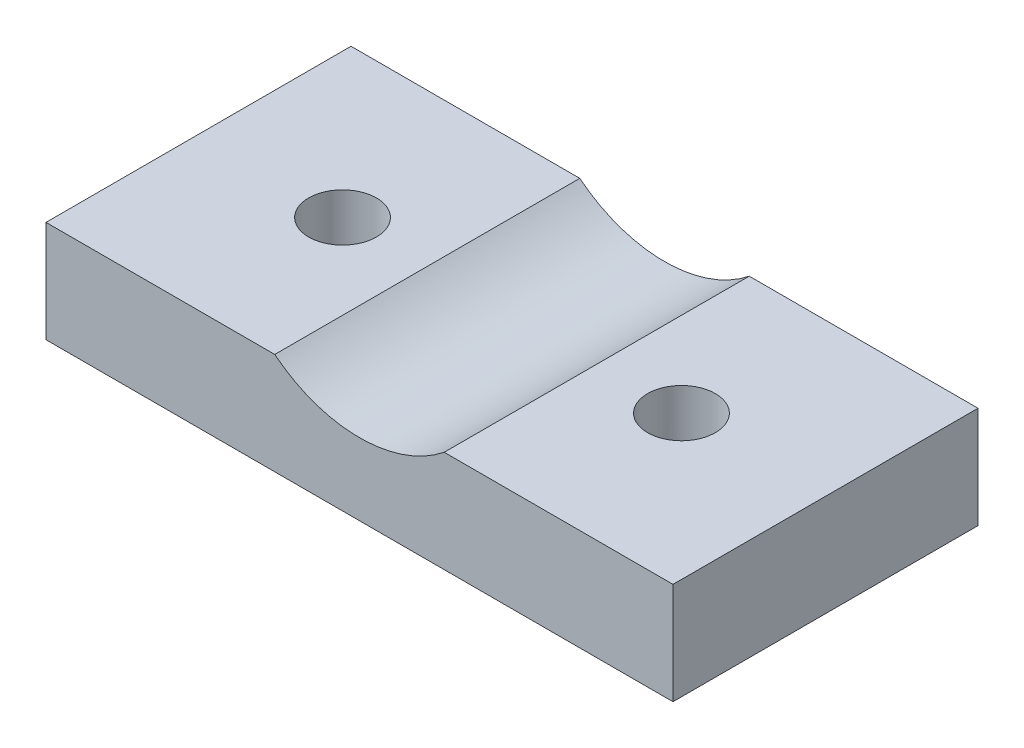
ISO-10303-21;
HEADER;
FILE_DESCRIPTION(('STEP AP214'),'2;1');
FILE_NAME('part.step','',(''),(''),'','','');
FILE_SCHEMA(('AUTOMOTIVE_DESIGN { 1 0 10303 214 1 1 1 1 }'));
ENDSEC;
DATA;
#1=APPLICATION_CONTEXT('core data for automotive mechanical design processes');
#2=APPLICATION_PROTOCOL_DEFINITION('international standard','automotive_design',2000,#1);
#3=PRODUCT_CONTEXT('',#1,'mechanical');
#4=PRODUCT('Part','Part','',(#3));
#5=PRODUCT_RELATED_PRODUCT_CATEGORY('part','',(#4));
#6=PRODUCT_DEFINITION_FORMATION('','',#4);
#7=PRODUCT_DEFINITION_CONTEXT('part definition',#1,'design');
#8=PRODUCT_DEFINITION('design','',#6,#7);
#9=PRODUCT_DEFINITION_SHAPE('','',#8);
#10=(LENGTH_UNIT() NAMED_UNIT(*) SI_UNIT(.MILLI.,.METRE.));
#11=(NAMED_UNIT(*) PLANE_ANGLE_UNIT() SI_UNIT($,.RADIAN.));
#12=(NAMED_UNIT(*) SI_UNIT($,.STERADIAN.) SOLID_ANGLE_UNIT());
#13=UNCERTAINTY_MEASURE_WITH_UNIT(LENGTH_MEASURE(1.E-05),#10,'distance_accuracy_value','');
#14=(GEOMETRIC_REPRESENTATION_CONTEXT(3) GLOBAL_UNCERTAINTY_ASSIGNED_CONTEXT((#13)) GLOBAL_UNIT_ASSIGNED_CONTEXT((#10,
#11,#12)) REPRESENTATION_CONTEXT('',''));
#15=CARTESIAN_POINT('',(0.,0.,0.));
#16=DIRECTION('',(0.,0.,1.));
#17=DIRECTION('',(1.,0.,0.));
#18=AXIS2_PLACEMENT_3D('',#15,#16,#17);
#19=CARTESIAN_POINT('',(10.,6.00000000000001,-36.));
#20=DIRECTION('',(0.,1.,0.));
#21=DIRECTION('',(-1.,0.,0.));
#22=AXIS2_PLACEMENT_3D('',#19,#20,#21);
#23=PLANE('',#22);
#24=DIRECTION('',(-1.,0.,0.));
#25=VECTOR('',#24,1.);
#26=CARTESIAN_POINT('',(10.,6.00000000000001,0.));
#27=LINE('',#26,#25);
#28=CARTESIAN_POINT('',(37.,6.00000000000001,0.));
#29=VERTEX_POINT('',#28);
#30=CARTESIAN_POINT('',(10.,6.00000000000001,0.));
#31=VERTEX_POINT('',#30);
#32=EDGE_CURVE('E126',#29,#31,#27,.T.);
#33=ORIENTED_EDGE('',*,*,#32,.F.);
#34=DIRECTION('',(0.,0.,1.));
#35=VECTOR('',#34,1.);
#36=CARTESIAN_POINT('',(37.,6.00000000000001,-36.));
#37=LINE('',#36,#35);
#38=CARTESIAN_POINT('',(37.,6.00000000000001,-36.));
#39=VERTEX_POINT('',#38);
#40=EDGE_CURVE('E40',#39,#29,#37,.T.);
#41=ORIENTED_EDGE('',*,*,#40,.F.);
#42=DIRECTION('',(-1.,0.,0.));
#43=VECTOR('',#42,1.);
#44=CARTESIAN_POINT('',(10.,6.00000000000001,-36.));
#45=LINE('',#44,#43);
#46=CARTESIAN_POINT('',(10.,6.00000000000001,-36.));
#47=VERTEX_POINT('',#46);
#48=EDGE_CURVE('E118',#39,#47,#45,.T.);
#49=ORIENTED_EDGE('',*,*,#48,.T.);
#50=DIRECTION('',(0.,0.,1.));
#51=VECTOR('',#50,1.);
#52=CARTESIAN_POINT('',(10.,6.00000000000001,-36.));
#53=LINE('',#52,#51);
#54=EDGE_CURVE('E141',#47,#31,#53,.T.);
#55=ORIENTED_EDGE('',*,*,#54,.T.);
#56=EDGE_LOOP('',(#33,#41,#49,#55));
#57=FACE_BOUND('',#56,.T.);
#58=CARTESIAN_POINT('',(20.,6.00000000000001,-18.));
#59=DIRECTION('',(0.,1.,0.));
#60=DIRECTION('',(0.,0.,-1.));
#61=AXIS2_PLACEMENT_3D('',#58,#59,#60);
#62=CIRCLE('',#61,4.);
#63=CARTESIAN_POINT('',(20.,6.00000000000001,-22.));
#64=VERTEX_POINT('',#63);
#65=EDGE_CURVE('E175',#64,#64,#62,.T.);
#66=ORIENTED_EDGE('',*,*,#65,.F.);
#67=EDGE_LOOP('',(#66));
#68=FACE_BOUND('',#67,.T.);
#69=ADVANCED_FACE('F36',(#57,#68),#23,.T.);
#70=CARTESIAN_POINT('',(-37.,6.00000000000001,-36.));
#71=DIRECTION('',(0.,1.,0.));
#72=DIRECTION('',(-1.,0.,0.));
#73=AXIS2_PLACEMENT_3D('',#70,#71,#72);
#74=PLANE('',#73);
#75=DIRECTION('',(-1.,0.,0.));
#76=VECTOR('',#75,1.);
#77=CARTESIAN_POINT('',(-37.,6.00000000000001,0.));
#78=LINE('',#77,#76);
#79=CARTESIAN_POINT('',(-10.,6.00000000000001,0.));
#80=VERTEX_POINT('',#79);
#81=CARTESIAN_POINT('',(-37.,6.00000000000001,0.));
#82=VERTEX_POINT('',#81);
#83=EDGE_CURVE('E133',#80,#82,#78,.T.);
#84=ORIENTED_EDGE('',*,*,#83,.F.);
#85=DIRECTION('',(0.,0.,1.));
#86=VECTOR('',#85,1.);
#87=CARTESIAN_POINT('',(-10.,6.00000000000001,-36.));
#88=LINE('',#87,#86);
#89=CARTESIAN_POINT('',(-10.,6.00000000000001,-36.));
#90=VERTEX_POINT('',#89);
#91=EDGE_CURVE('E104',#90,#80,#88,.T.);
#92=ORIENTED_EDGE('',*,*,#91,.F.);
#93=DIRECTION('',(-1.,0.,0.));
#94=VECTOR('',#93,1.);
#95=CARTESIAN_POINT('',(-37.,6.00000000000001,-36.));
#96=LINE('',#95,#94);
#97=CARTESIAN_POINT('',(-37.,6.00000000000001,-36.));
#98=VERTEX_POINT('',#97);
#99=EDGE_CURVE('E110',#90,#98,#96,.T.);
#100=ORIENTED_EDGE('',*,*,#99,.T.);
#101=DIRECTION('',(0.,0.,1.));
#102=VECTOR('',#101,1.);
#103=CARTESIAN_POINT('',(-37.,6.00000000000001,-36.));
#104=LINE('',#103,#102);
#105=EDGE_CURVE('E94',#98,#82,#104,.T.);
#106=ORIENTED_EDGE('',*,*,#105,.T.);
#107=EDGE_LOOP('',(#84,#92,#100,#106));
#108=FACE_BOUND('',#107,.T.);
#109=CARTESIAN_POINT('',(-20.,6.00000000000001,-18.));
#110=DIRECTION('',(0.,1.,0.));
#111=DIRECTION('',(0.,0.,1.));
#112=AXIS2_PLACEMENT_3D('',#109,#110,#111);
#113=CIRCLE('',#112,4.);
#114=CARTESIAN_POINT('',(-20.,6.00000000000001,-14.));
#115=VERTEX_POINT('',#114);
#116=EDGE_CURVE('E127',#115,#115,#113,.T.);
#117=ORIENTED_EDGE('',*,*,#116,.F.);
#118=EDGE_LOOP('',(#117));
#119=FACE_BOUND('',#118,.T.);
#120=ADVANCED_FACE('F114',(#108,#119),#74,.T.);
#121=CARTESIAN_POINT('',(37.,6.00000000000001,-36.));
#122=DIRECTION('',(1.,0.,0.));
#123=DIRECTION('',(0.,1.,0.));
#124=AXIS2_PLACEMENT_3D('',#121,#122,#123);
#125=PLANE('',#124);
#126=DIRECTION('',(0.,1.,0.));
#127=VECTOR('',#126,1.);
#128=CARTESIAN_POINT('',(37.,6.00000000000001,0.));
#129=LINE('',#128,#127);
#130=CARTESIAN_POINT('',(37.,-5.99999999999999,0.));
#131=VERTEX_POINT('',#130);
#132=EDGE_CURVE('E123',#131,#29,#129,.T.);
#133=ORIENTED_EDGE('',*,*,#132,.F.);
#134=DIRECTION('',(0.,0.,1.));
#135=VECTOR('',#134,1.);
#136=CARTESIAN_POINT('',(37.,-5.99999999999999,-36.));
#137=LINE('',#136,#135);
#138=CARTESIAN_POINT('',(37.,-5.99999999999999,-36.));
#139=VERTEX_POINT('',#138);
#140=EDGE_CURVE('E11',#139,#131,#137,.T.);
#141=ORIENTED_EDGE('',*,*,#140,.F.);
#142=DIRECTION('',(0.,1.,0.));
#143=VECTOR('',#142,1.);
#144=CARTESIAN_POINT('',(37.,6.00000000000001,-36.));
#145=LINE('',#144,#143);
#146=EDGE_CURVE('E138',#139,#39,#145,.T.);
#147=ORIENTED_EDGE('',*,*,#146,.T.);
#148=ORIENTED_EDGE('',*,*,#40,.T.);
#149=EDGE_LOOP('',(#133,#141,#147,#148));
#150=FACE_BOUND('',#149,.T.);
#151=ADVANCED_FACE('F38',(#150),#125,.T.);
#152=CARTESIAN_POINT('',(-37.,-5.99999999999999,-36.));
#153=DIRECTION('',(0.,-1.,0.));
#154=DIRECTION('',(0.,0.,-1.));
#155=AXIS2_PLACEMENT_3D('',#152,#153,#154);
#156=PLANE('',#155);
#157=CARTESIAN_POINT('',(20.,-5.99999999999999,-18.));
#158=DIRECTION('',(0.,1.,0.));
#159=DIRECTION('',(0.,0.,1.));
#160=AXIS2_PLACEMENT_3D('',#157,#158,#159);
#161=CIRCLE('',#160,4.);
#162=CARTESIAN_POINT('',(20.,-5.99999999999999,-14.));
#163=VERTEX_POINT('',#162);
#164=EDGE_CURVE('E181',#163,#163,#161,.T.);
#165=ORIENTED_EDGE('',*,*,#164,.T.);
#166=EDGE_LOOP('',(#165));
#167=FACE_BOUND('',#166,.T.);
#168=CARTESIAN_POINT('',(-20.,-5.99999999999999,-18.));
#169=DIRECTION('',(0.,1.,0.));
#170=DIRECTION('',(0.,0.,1.));
#171=AXIS2_PLACEMENT_3D('',#168,#169,#170);
#172=CIRCLE('',#171,4.);
#173=CARTESIAN_POINT('',(-20.,-5.99999999999999,-14.));
#174=VERTEX_POINT('',#173);
#175=EDGE_CURVE('E178',#174,#174,#172,.T.);
#176=ORIENTED_EDGE('',*,*,#175,.T.);
#177=EDGE_LOOP('',(#176));
#178=FACE_BOUND('',#177,.T.);
#179=DIRECTION('',(1.,0.,0.));
#180=VECTOR('',#179,1.);
#181=CARTESIAN_POINT('',(-37.,-5.99999999999999,0.));
#182=LINE('',#181,#180);
#183=CARTESIAN_POINT('',(-37.,-5.99999999999999,0.));
#184=VERTEX_POINT('',#183);
#185=EDGE_CURVE('E136',#184,#131,#182,.T.);
#186=ORIENTED_EDGE('',*,*,#185,.F.);
#187=DIRECTION('',(0.,0.,1.));
#188=VECTOR('',#187,1.);
#189=CARTESIAN_POINT('',(-37.,-5.99999999999999,-36.));
#190=LINE('',#189,#188);
#191=CARTESIAN_POINT('',(-37.,-5.99999999999999,-36.));
#192=VERTEX_POINT('',#191);
#193=EDGE_CURVE('E46',#192,#184,#190,.T.);
#194=ORIENTED_EDGE('',*,*,#193,.F.);
#195=DIRECTION('',(1.,0.,0.));
#196=VECTOR('',#195,1.);
#197=CARTESIAN_POINT('',(-37.,-5.99999999999999,-36.));
#198=LINE('',#197,#196);
#199=EDGE_CURVE('E112',#192,#139,#198,.T.);
#200=ORIENTED_EDGE('',*,*,#199,.T.);
#201=ORIENTED_EDGE('',*,*,#140,.T.);
#202=EDGE_LOOP('',(#186,#194,#200,#201));
#203=FACE_BOUND('',#202,.T.);
#204=ADVANCED_FACE('F146',(#167,#178,#203),#156,.T.);
#205=CARTESIAN_POINT('',(-37.,6.00000000000001,-36.));
#206=DIRECTION('',(-1.,0.,0.));
#207=DIRECTION('',(0.,-1.,0.));
#208=AXIS2_PLACEMENT_3D('',#205,#206,#207);
#209=PLANE('',#208);
#210=DIRECTION('',(0.,-1.,0.));
#211=VECTOR('',#210,1.);
#212=CARTESIAN_POINT('',(-37.,6.00000000000001,0.));
#213=LINE('',#212,#211);
#214=EDGE_CURVE('E99',#82,#184,#213,.T.);
#215=ORIENTED_EDGE('',*,*,#214,.F.);
#216=ORIENTED_EDGE('',*,*,#105,.F.);
#217=DIRECTION('',(0.,-1.,0.));
#218=VECTOR('',#217,1.);
#219=CARTESIAN_POINT('',(-37.,6.00000000000001,-36.));
#220=LINE('',#219,#218);
#221=EDGE_CURVE('E97',#98,#192,#220,.T.);
#222=ORIENTED_EDGE('',*,*,#221,.T.);
#223=ORIENTED_EDGE('',*,*,#193,.T.);
#224=EDGE_LOOP('',(#215,#216,#222,#223));
#225=FACE_BOUND('',#224,.T.);
#226=ADVANCED_FACE('F96',(#225),#209,.T.);
#227=CARTESIAN_POINT('',(0.,18.4899959967968,-36.));
#228=DIRECTION('',(0.,0.,1.));
#229=DIRECTION('',(1.,0.,0.));
#230=AXIS2_PLACEMENT_3D('',#227,#228,#229);
#231=CYLINDRICAL_SURFACE('',#230,16.);
#232=CARTESIAN_POINT('',(0.,18.4899959967968,0.));
#233=DIRECTION('',(0.,0.,-1.));
#234=DIRECTION('',(1.,0.,0.));
#235=AXIS2_PLACEMENT_3D('',#232,#233,#234);
#236=CIRCLE('',#235,16.);
#237=EDGE_CURVE('E130',#31,#80,#236,.T.);
#238=ORIENTED_EDGE('',*,*,#237,.F.);
#239=ORIENTED_EDGE('',*,*,#54,.F.);
#240=CARTESIAN_POINT('',(0.,18.4899959967968,-36.));
#241=DIRECTION('',(0.,0.,-1.));
#242=DIRECTION('',(1.,0.,0.));
#243=AXIS2_PLACEMENT_3D('',#240,#241,#242);
#244=CIRCLE('',#243,16.);
#245=EDGE_CURVE('E116',#47,#90,#244,.T.);
#246=ORIENTED_EDGE('',*,*,#245,.T.);
#247=ORIENTED_EDGE('',*,*,#91,.T.);
#248=EDGE_LOOP('',(#238,#239,#246,#247));
#249=FACE_BOUND('',#248,.T.);
#250=ADVANCED_FACE('F154',(#249),#231,.F.);
#251=CARTESIAN_POINT('',(0.,18.4899959967968,-36.));
#252=DIRECTION('',(0.,0.,1.));
#253=DIRECTION('',(1.,0.,0.));
#254=AXIS2_PLACEMENT_3D('',#251,#252,#253);
#255=PLANE('',#254);
#256=ORIENTED_EDGE('',*,*,#146,.F.);
#257=ORIENTED_EDGE('',*,*,#199,.F.);
#258=ORIENTED_EDGE('',*,*,#221,.F.);
#259=ORIENTED_EDGE('',*,*,#99,.F.);
#260=ORIENTED_EDGE('',*,*,#245,.F.);
#261=ORIENTED_EDGE('',*,*,#48,.F.);
#262=EDGE_LOOP('',(#256,#257,#258,#259,#260,#261));
#263=FACE_BOUND('',#262,.T.);
#264=ADVANCED_FACE('F108',(#263),#255,.F.);
#265=CARTESIAN_POINT('',(0.,18.4899959967968,0.));
#266=DIRECTION('',(0.,0.,1.));
#267=DIRECTION('',(1.,0.,0.));
#268=AXIS2_PLACEMENT_3D('',#265,#266,#267);
#269=PLANE('',#268);
#270=ORIENTED_EDGE('',*,*,#132,.T.);
#271=ORIENTED_EDGE('',*,*,#32,.T.);
#272=ORIENTED_EDGE('',*,*,#237,.T.);
#273=ORIENTED_EDGE('',*,*,#83,.T.);
#274=ORIENTED_EDGE('',*,*,#214,.T.);
#275=ORIENTED_EDGE('',*,*,#185,.T.);
#276=EDGE_LOOP('',(#270,#271,#272,#273,#274,#275));
#277=FACE_BOUND('',#276,.T.);
#278=ADVANCED_FACE('F145',(#277),#269,.T.);
#279=CARTESIAN_POINT('',(-20.,6.00000000000001,-18.));
#280=DIRECTION('',(0.,-1.,0.));
#281=DIRECTION('',(0.,0.,-1.));
#282=AXIS2_PLACEMENT_3D('',#279,#280,#281);
#283=CYLINDRICAL_SURFACE('',#282,4.);
#284=ORIENTED_EDGE('',*,*,#116,.T.);
#285=EDGE_LOOP('',(#284));
#286=FACE_BOUND('',#285,.T.);
#287=ORIENTED_EDGE('',*,*,#175,.F.);
#288=EDGE_LOOP('',(#287));
#289=FACE_BOUND('',#288,.T.);
#290=ADVANCED_FACE('F186',(#286,#289),#283,.F.);
#291=CARTESIAN_POINT('',(20.,6.00000000000001,-18.));
#292=DIRECTION('',(0.,-1.,0.));
#293=DIRECTION('',(0.,0.,-1.));
#294=AXIS2_PLACEMENT_3D('',#291,#292,#293);
#295=CYLINDRICAL_SURFACE('',#294,4.);
#296=ORIENTED_EDGE('',*,*,#65,.T.);
#297=EDGE_LOOP('',(#296));
#298=FACE_BOUND('',#297,.T.);
#299=ORIENTED_EDGE('',*,*,#164,.F.);
#300=EDGE_LOOP('',(#299));
#301=FACE_BOUND('',#300,.T.);
#302=ADVANCED_FACE('F184',(#298,#301),#295,.F.);
#303=CLOSED_SHELL('',(#69,#120,#151,#204,#226,#250,#264,#278,#290,#302));
#304=MANIFOLD_SOLID_BREP('B2',#303);
#305=ADVANCED_BREP_SHAPE_REPRESENTATION('',(#18,#304),#14);
#306=SHAPE_DEFINITION_REPRESENTATION(#9,#305);
ENDSEC;
END-ISO-10303-21;
